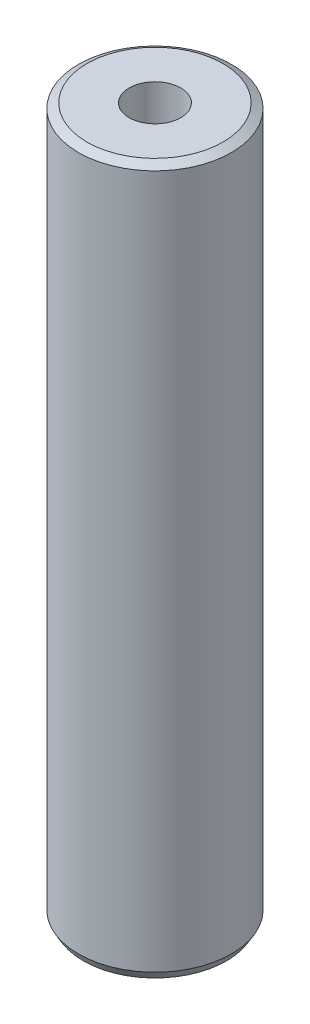
ISO-10303-21;
HEADER;
FILE_DESCRIPTION(('STEP AP214'),'2;1');
FILE_NAME('part.step','',(''),(''),'','','');
FILE_SCHEMA(('AUTOMOTIVE_DESIGN { 1 0 10303 214 1 1 1 1 }'));
ENDSEC;
DATA;
#1=APPLICATION_CONTEXT('core data for automotive mechanical design processes');
#2=APPLICATION_PROTOCOL_DEFINITION('international standard','automotive_design',2000,#1);
#3=PRODUCT_CONTEXT('',#1,'mechanical');
#4=PRODUCT('Part','Part','',(#3));
#5=PRODUCT_RELATED_PRODUCT_CATEGORY('part','',(#4));
#6=PRODUCT_DEFINITION_FORMATION('','',#4);
#7=PRODUCT_DEFINITION_CONTEXT('part definition',#1,'design');
#8=PRODUCT_DEFINITION('design','',#6,#7);
#9=PRODUCT_DEFINITION_SHAPE('','',#8);
#10=(LENGTH_UNIT() NAMED_UNIT(*) SI_UNIT(.MILLI.,.METRE.));
#11=(NAMED_UNIT(*) PLANE_ANGLE_UNIT() SI_UNIT($,.RADIAN.));
#12=(NAMED_UNIT(*) SI_UNIT($,.STERADIAN.) SOLID_ANGLE_UNIT());
#13=UNCERTAINTY_MEASURE_WITH_UNIT(LENGTH_MEASURE(1.E-05),#10,'distance_accuracy_value','');
#14=(GEOMETRIC_REPRESENTATION_CONTEXT(3) GLOBAL_UNCERTAINTY_ASSIGNED_CONTEXT((#13)) GLOBAL_UNIT_ASSIGNED_CONTEXT((#10,
#11,#12)) REPRESENTATION_CONTEXT('',''));
#15=CARTESIAN_POINT('',(0.,0.,0.));
#16=DIRECTION('',(0.,0.,1.));
#17=DIRECTION('',(1.,0.,0.));
#18=AXIS2_PLACEMENT_3D('',#15,#16,#17);
#19=CARTESIAN_POINT('',(0.,277.401554563949,0.));
#20=DIRECTION('',(0.,-1.,0.));
#21=DIRECTION('',(0.,0.,-1.));
#22=AXIS2_PLACEMENT_3D('',#19,#20,#21);
#23=CYLINDRICAL_SURFACE('',#22,30.);
#24=CARTESIAN_POINT('',(0.,275.486842857775,0.));
#25=DIRECTION('',(0.,1.,0.));
#26=DIRECTION('',(0.,0.,1.));
#27=AXIS2_PLACEMENT_3D('',#24,#25,#26);
#28=CIRCLE('',#27,30.);
#29=CARTESIAN_POINT('',(0.,275.486842857775,30.));
#30=VERTEX_POINT('',#29);
#31=EDGE_CURVE('E50',#30,#30,#28,.F.);
#32=ORIENTED_EDGE('',*,*,#31,.T.);
#33=EDGE_LOOP('',(#32));
#34=FACE_BOUND('',#33,.T.);
#35=CARTESIAN_POINT('',(0.,3.31637795694023,0.));
#36=DIRECTION('',(0.,1.,0.));
#37=DIRECTION('',(0.,0.,1.));
#38=AXIS2_PLACEMENT_3D('',#35,#36,#37);
#39=CIRCLE('',#38,30.);
#40=CARTESIAN_POINT('',(0.,3.31637795694023,30.));
#41=VERTEX_POINT('',#40);
#42=EDGE_CURVE('E51',#41,#41,#39,.T.);
#43=ORIENTED_EDGE('',*,*,#42,.T.);
#44=EDGE_LOOP('',(#43));
#45=FACE_BOUND('',#44,.T.);
#46=ADVANCED_FACE('F39',(#34,#45),#23,.T.);
#47=CARTESIAN_POINT('',(0.,277.401554563949,0.));
#48=DIRECTION('',(0.,1.,0.));
#49=DIRECTION('',(0.,0.,1.));
#50=AXIS2_PLACEMENT_3D('',#47,#48,#49);
#51=PLANE('',#50);
#52=CARTESIAN_POINT('',(0.,277.401554563949,0.));
#53=DIRECTION('',(0.,1.,0.));
#54=DIRECTION('',(0.,0.,1.));
#55=AXIS2_PLACEMENT_3D('',#52,#53,#54);
#56=CIRCLE('',#55,26.6836220430597);
#57=CARTESIAN_POINT('',(0.,277.401554563949,26.6836220430597));
#58=VERTEX_POINT('',#57);
#59=EDGE_CURVE('E54',#58,#58,#56,.T.);
#60=ORIENTED_EDGE('',*,*,#59,.T.);
#61=EDGE_LOOP('',(#60));
#62=FACE_BOUND('',#61,.T.);
#63=CARTESIAN_POINT('',(0.,277.401554563949,0.));
#64=DIRECTION('',(0.,1.,0.));
#65=DIRECTION('',(0.,0.,1.));
#66=AXIS2_PLACEMENT_3D('',#63,#64,#65);
#67=CIRCLE('',#66,10.1236448507395);
#68=CARTESIAN_POINT('',(0.,277.401554563949,10.1236448507395));
#69=VERTEX_POINT('',#68);
#70=EDGE_CURVE('E58',#69,#69,#67,.T.);
#71=ORIENTED_EDGE('',*,*,#70,.F.);
#72=EDGE_LOOP('',(#71));
#73=FACE_BOUND('',#72,.T.);
#74=ADVANCED_FACE('F69',(#62,#73),#51,.T.);
#75=CARTESIAN_POINT('',(0.,0.,0.));
#76=DIRECTION('',(0.,1.,0.));
#77=DIRECTION('',(0.,0.,1.));
#78=AXIS2_PLACEMENT_3D('',#75,#76,#77);
#79=PLANE('',#78);
#80=CARTESIAN_POINT('',(0.,0.,0.));
#81=DIRECTION('',(0.,1.,0.));
#82=DIRECTION('',(0.,0.,1.));
#83=AXIS2_PLACEMENT_3D('',#80,#81,#82);
#84=CIRCLE('',#83,28.085288293826);
#85=CARTESIAN_POINT('',(0.,0.,28.085288293826));
#86=VERTEX_POINT('',#85);
#87=EDGE_CURVE('E10',#86,#86,#84,.F.);
#88=ORIENTED_EDGE('',*,*,#87,.T.);
#89=EDGE_LOOP('',(#88));
#90=FACE_BOUND('',#89,.T.);
#91=CARTESIAN_POINT('',(0.,0.,0.));
#92=DIRECTION('',(0.,1.,0.));
#93=DIRECTION('',(0.,0.,1.));
#94=AXIS2_PLACEMENT_3D('',#91,#92,#93);
#95=CIRCLE('',#94,10.1236448507395);
#96=CARTESIAN_POINT('',(0.,0.,10.1236448507395));
#97=VERTEX_POINT('',#96);
#98=EDGE_CURVE('E63',#97,#97,#95,.T.);
#99=ORIENTED_EDGE('',*,*,#98,.T.);
#100=EDGE_LOOP('',(#99));
#101=FACE_BOUND('',#100,.T.);
#102=ADVANCED_FACE('F75',(#90,#101),#79,.F.);
#103=CARTESIAN_POINT('',(0.,277.401554563949,0.));
#104=DIRECTION('',(0.,-1.,0.));
#105=DIRECTION('',(0.,0.,-1.));
#106=AXIS2_PLACEMENT_3D('',#103,#104,#105);
#107=CYLINDRICAL_SURFACE('',#106,10.1236448507395);
#108=ORIENTED_EDGE('',*,*,#70,.T.);
#109=EDGE_LOOP('',(#108));
#110=FACE_BOUND('',#109,.T.);
#111=ORIENTED_EDGE('',*,*,#98,.F.);
#112=EDGE_LOOP('',(#111));
#113=FACE_BOUND('',#112,.T.);
#114=ADVANCED_FACE('F70',(#110,#113),#107,.F.);
#115=CARTESIAN_POINT('',(0.,277.401554563949,0.));
#116=DIRECTION('',(0.,-1.,0.));
#117=DIRECTION('',(0.,0.,-1.));
#118=AXIS2_PLACEMENT_3D('',#115,#116,#117);
#119=CONICAL_SURFACE('',#118,26.6836220430597,1.0471975511966);
#120=ORIENTED_EDGE('',*,*,#31,.F.);
#121=EDGE_LOOP('',(#120));
#122=FACE_BOUND('',#121,.T.);
#123=ORIENTED_EDGE('',*,*,#59,.F.);
#124=EDGE_LOOP('',(#123));
#125=FACE_BOUND('',#124,.T.);
#126=ADVANCED_FACE('F81',(#122,#125),#119,.T.);
#127=CARTESIAN_POINT('',(0.,3.31637795694023,0.));
#128=DIRECTION('',(0.,1.,0.));
#129=DIRECTION('',(0.,0.,1.));
#130=AXIS2_PLACEMENT_3D('',#127,#128,#129);
#131=CONICAL_SURFACE('',#130,30.,0.523598775598304);
#132=ORIENTED_EDGE('',*,*,#87,.F.);
#133=EDGE_LOOP('',(#132));
#134=FACE_BOUND('',#133,.T.);
#135=ORIENTED_EDGE('',*,*,#42,.F.);
#136=EDGE_LOOP('',(#135));
#137=FACE_BOUND('',#136,.T.);
#138=ADVANCED_FACE('F45',(#134,#137),#131,.T.);
#139=CLOSED_SHELL('',(#46,#74,#102,#114,#126,#138));
#140=MANIFOLD_SOLID_BREP('B2',#139);
#141=ADVANCED_BREP_SHAPE_REPRESENTATION('',(#18,#140),#14);
#142=SHAPE_DEFINITION_REPRESENTATION(#9,#141);
ENDSEC;
END-ISO-10303-21;
